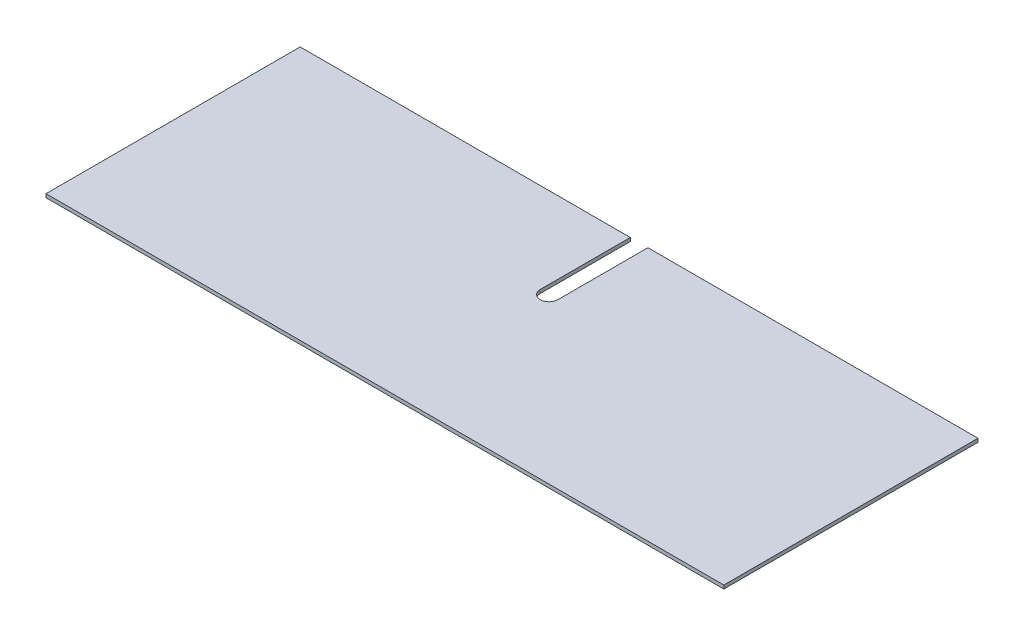
ISO-10303-21;
HEADER;
FILE_DESCRIPTION(('STEP AP214'),'2;1');
FILE_NAME('part.step','',(''),(''),'','','');
FILE_SCHEMA(('AUTOMOTIVE_DESIGN { 1 0 10303 214 1 1 1 1 }'));
ENDSEC;
DATA;
#1=APPLICATION_CONTEXT('core data for automotive mechanical design processes');
#2=APPLICATION_PROTOCOL_DEFINITION('international standard','automotive_design',2000,#1);
#3=PRODUCT_CONTEXT('',#1,'mechanical');
#4=PRODUCT('Part','Part','',(#3));
#5=PRODUCT_RELATED_PRODUCT_CATEGORY('part','',(#4));
#6=PRODUCT_DEFINITION_FORMATION('','',#4);
#7=PRODUCT_DEFINITION_CONTEXT('part definition',#1,'design');
#8=PRODUCT_DEFINITION('design','',#6,#7);
#9=PRODUCT_DEFINITION_SHAPE('','',#8);
#10=(LENGTH_UNIT() NAMED_UNIT(*) SI_UNIT(.MILLI.,.METRE.));
#11=(NAMED_UNIT(*) PLANE_ANGLE_UNIT() SI_UNIT($,.RADIAN.));
#12=(NAMED_UNIT(*) SI_UNIT($,.STERADIAN.) SOLID_ANGLE_UNIT());
#13=UNCERTAINTY_MEASURE_WITH_UNIT(LENGTH_MEASURE(1.E-05),#10,'distance_accuracy_value','');
#14=(GEOMETRIC_REPRESENTATION_CONTEXT(3) GLOBAL_UNCERTAINTY_ASSIGNED_CONTEXT((#13)) GLOBAL_UNIT_ASSIGNED_CONTEXT((#10,
#11,#12)) REPRESENTATION_CONTEXT('',''));
#15=CARTESIAN_POINT('',(0.,0.,0.));
#16=DIRECTION('',(0.,0.,1.));
#17=DIRECTION('',(1.,0.,0.));
#18=AXIS2_PLACEMENT_3D('',#15,#16,#17);
#19=CARTESIAN_POINT('',(0.,3.175,0.));
#20=DIRECTION('',(0.,1.,0.));
#21=DIRECTION('',(0.,0.,1.));
#22=AXIS2_PLACEMENT_3D('',#19,#20,#21);
#23=PLANE('',#22);
#24=CARTESIAN_POINT('',(0.,3.175,-33.3375));
#25=DIRECTION('',(0.,1.,0.));
#26=DIRECTION('',(0.,0.,1.));
#27=AXIS2_PLACEMENT_3D('',#24,#25,#26);
#28=CIRCLE('',#27,7.9375);
#29=CARTESIAN_POINT('',(7.9375,3.175,-33.3375));
#30=VERTEX_POINT('',#29);
#31=CARTESIAN_POINT('',(-7.9375,3.175,-33.3375));
#32=VERTEX_POINT('',#31);
#33=EDGE_CURVE('E19',#30,#32,#28,.F.);
#34=ORIENTED_EDGE('',*,*,#33,.T.);
#35=DIRECTION('',(0.,0.,1.));
#36=VECTOR('',#35,1.);
#37=CARTESIAN_POINT('',(-7.9375,3.175,-114.3));
#38=LINE('',#37,#36);
#39=CARTESIAN_POINT('',(-7.93749999999999,3.175,-114.3));
#40=VERTEX_POINT('',#39);
#41=EDGE_CURVE('E57',#32,#40,#38,.F.);
#42=ORIENTED_EDGE('',*,*,#41,.T.);
#43=DIRECTION('',(-1.,0.,0.));
#44=VECTOR('',#43,1.);
#45=CARTESIAN_POINT('',(304.8,3.175,-114.3));
#46=LINE('',#45,#44);
#47=CARTESIAN_POINT('',(-304.8,3.175,-114.3));
#48=VERTEX_POINT('',#47);
#49=EDGE_CURVE('E93',#48,#40,#46,.F.);
#50=ORIENTED_EDGE('',*,*,#49,.F.);
#51=DIRECTION('',(0.,0.,1.));
#52=VECTOR('',#51,1.);
#53=CARTESIAN_POINT('',(-304.8,3.175,-114.3));
#54=LINE('',#53,#52);
#55=CARTESIAN_POINT('',(-304.8,3.175,114.3));
#56=VERTEX_POINT('',#55);
#57=EDGE_CURVE('E88',#56,#48,#54,.F.);
#58=ORIENTED_EDGE('',*,*,#57,.F.);
#59=DIRECTION('',(1.,0.,0.));
#60=VECTOR('',#59,1.);
#61=CARTESIAN_POINT('',(-304.8,3.175,114.3));
#62=LINE('',#61,#60);
#63=CARTESIAN_POINT('',(304.8,3.175,114.3));
#64=VERTEX_POINT('',#63);
#65=EDGE_CURVE('E129',#64,#56,#62,.F.);
#66=ORIENTED_EDGE('',*,*,#65,.F.);
#67=DIRECTION('',(0.,0.,-1.));
#68=VECTOR('',#67,1.);
#69=CARTESIAN_POINT('',(304.8,3.175,114.3));
#70=LINE('',#69,#68);
#71=CARTESIAN_POINT('',(304.8,3.175,-114.3));
#72=VERTEX_POINT('',#71);
#73=EDGE_CURVE('E124',#72,#64,#70,.F.);
#74=ORIENTED_EDGE('',*,*,#73,.F.);
#75=DIRECTION('',(-1.,0.,0.));
#76=VECTOR('',#75,1.);
#77=CARTESIAN_POINT('',(304.8,3.175,-114.3));
#78=LINE('',#77,#76);
#79=CARTESIAN_POINT('',(7.93749999999999,3.175,-114.3));
#80=VERTEX_POINT('',#79);
#81=EDGE_CURVE('E63',#80,#72,#78,.F.);
#82=ORIENTED_EDGE('',*,*,#81,.F.);
#83=DIRECTION('',(0.,0.,-1.));
#84=VECTOR('',#83,1.);
#85=CARTESIAN_POINT('',(7.9375,3.175,-33.3375));
#86=LINE('',#85,#84);
#87=EDGE_CURVE('E50',#80,#30,#86,.F.);
#88=ORIENTED_EDGE('',*,*,#87,.T.);
#89=EDGE_LOOP('',(#34,#42,#50,#58,#66,#74,#82,#88));
#90=FACE_BOUND('',#89,.T.);
#91=ADVANCED_FACE('F16',(#90),#23,.T.);
#92=CARTESIAN_POINT('',(-7.9375,3.175,-114.3));
#93=DIRECTION('',(-1.,0.,0.));
#94=DIRECTION('',(0.,0.,1.));
#95=AXIS2_PLACEMENT_3D('',#92,#93,#94);
#96=PLANE('',#95);
#97=ORIENTED_EDGE('',*,*,#41,.F.);
#98=DIRECTION('',(0.,1.,0.));
#99=VECTOR('',#98,1.);
#100=CARTESIAN_POINT('',(-7.9375,3.175,-33.3375));
#101=LINE('',#100,#99);
#102=CARTESIAN_POINT('',(-7.9375,0.,-33.3375));
#103=VERTEX_POINT('',#102);
#104=EDGE_CURVE('E113',#32,#103,#101,.F.);
#105=ORIENTED_EDGE('',*,*,#104,.T.);
#106=DIRECTION('',(0.,0.,1.));
#107=VECTOR('',#106,1.);
#108=CARTESIAN_POINT('',(-7.9375,0.,0.));
#109=LINE('',#108,#107);
#110=CARTESIAN_POINT('',(-7.93749999999999,0.,-114.3));
#111=VERTEX_POINT('',#110);
#112=EDGE_CURVE('E103',#103,#111,#109,.F.);
#113=ORIENTED_EDGE('',*,*,#112,.T.);
#114=DIRECTION('',(0.,1.,0.));
#115=VECTOR('',#114,1.);
#116=CARTESIAN_POINT('',(-7.93749999999999,0.,-114.3));
#117=LINE('',#116,#115);
#118=EDGE_CURVE('E96',#40,#111,#117,.F.);
#119=ORIENTED_EDGE('',*,*,#118,.F.);
#120=EDGE_LOOP('',(#97,#105,#113,#119));
#121=FACE_BOUND('',#120,.T.);
#122=ADVANCED_FACE('F102',(#121),#96,.F.);
#123=CARTESIAN_POINT('',(304.8,0.,-114.3));
#124=DIRECTION('',(0.,0.,-1.));
#125=DIRECTION('',(-1.,0.,0.));
#126=AXIS2_PLACEMENT_3D('',#123,#124,#125);
#127=PLANE('',#126);
#128=ORIENTED_EDGE('',*,*,#49,.T.);
#129=ORIENTED_EDGE('',*,*,#118,.T.);
#130=DIRECTION('',(1.,0.,0.));
#131=VECTOR('',#130,1.);
#132=CARTESIAN_POINT('',(0.,0.,-114.3));
#133=LINE('',#132,#131);
#134=CARTESIAN_POINT('',(-304.8,0.,-114.3));
#135=VERTEX_POINT('',#134);
#136=EDGE_CURVE('E148',#111,#135,#133,.F.);
#137=ORIENTED_EDGE('',*,*,#136,.T.);
#138=DIRECTION('',(0.,1.,0.));
#139=VECTOR('',#138,1.);
#140=CARTESIAN_POINT('',(-304.8,0.,-114.3));
#141=LINE('',#140,#139);
#142=EDGE_CURVE('E98',#48,#135,#141,.F.);
#143=ORIENTED_EDGE('',*,*,#142,.F.);
#144=EDGE_LOOP('',(#128,#129,#137,#143));
#145=FACE_BOUND('',#144,.T.);
#146=ADVANCED_FACE('F94',(#145),#127,.T.);
#147=CARTESIAN_POINT('',(-304.8,0.,-114.3));
#148=DIRECTION('',(-1.,0.,0.));
#149=DIRECTION('',(0.,0.,1.));
#150=AXIS2_PLACEMENT_3D('',#147,#148,#149);
#151=PLANE('',#150);
#152=ORIENTED_EDGE('',*,*,#142,.T.);
#153=DIRECTION('',(0.,0.,1.));
#154=VECTOR('',#153,1.);
#155=CARTESIAN_POINT('',(-304.8,0.,0.));
#156=LINE('',#155,#154);
#157=CARTESIAN_POINT('',(-304.8,0.,114.3));
#158=VERTEX_POINT('',#157);
#159=EDGE_CURVE('E149',#135,#158,#156,.T.);
#160=ORIENTED_EDGE('',*,*,#159,.T.);
#161=DIRECTION('',(0.,1.,0.));
#162=VECTOR('',#161,1.);
#163=CARTESIAN_POINT('',(-304.8,0.,114.3));
#164=LINE('',#163,#162);
#165=EDGE_CURVE('E126',#56,#158,#164,.F.);
#166=ORIENTED_EDGE('',*,*,#165,.F.);
#167=ORIENTED_EDGE('',*,*,#57,.T.);
#168=EDGE_LOOP('',(#152,#160,#166,#167));
#169=FACE_BOUND('',#168,.T.);
#170=ADVANCED_FACE('F193',(#169),#151,.T.);
#171=CARTESIAN_POINT('',(-304.8,0.,114.3));
#172=DIRECTION('',(0.,0.,1.));
#173=DIRECTION('',(1.,0.,0.));
#174=AXIS2_PLACEMENT_3D('',#171,#172,#173);
#175=PLANE('',#174);
#176=ORIENTED_EDGE('',*,*,#165,.T.);
#177=DIRECTION('',(1.,0.,0.));
#178=VECTOR('',#177,1.);
#179=CARTESIAN_POINT('',(0.,0.,114.3));
#180=LINE('',#179,#178);
#181=CARTESIAN_POINT('',(304.8,0.,114.3));
#182=VERTEX_POINT('',#181);
#183=EDGE_CURVE('E150',#158,#182,#180,.T.);
#184=ORIENTED_EDGE('',*,*,#183,.T.);
#185=DIRECTION('',(0.,1.,0.));
#186=VECTOR('',#185,1.);
#187=CARTESIAN_POINT('',(304.8,0.,114.3));
#188=LINE('',#187,#186);
#189=EDGE_CURVE('E121',#64,#182,#188,.F.);
#190=ORIENTED_EDGE('',*,*,#189,.F.);
#191=ORIENTED_EDGE('',*,*,#65,.T.);
#192=EDGE_LOOP('',(#176,#184,#190,#191));
#193=FACE_BOUND('',#192,.T.);
#194=ADVANCED_FACE('F187',(#193),#175,.T.);
#195=CARTESIAN_POINT('',(304.8,0.,114.3));
#196=DIRECTION('',(1.,0.,0.));
#197=DIRECTION('',(0.,0.,-1.));
#198=AXIS2_PLACEMENT_3D('',#195,#196,#197);
#199=PLANE('',#198);
#200=ORIENTED_EDGE('',*,*,#189,.T.);
#201=DIRECTION('',(0.,0.,1.));
#202=VECTOR('',#201,1.);
#203=CARTESIAN_POINT('',(304.8,0.,0.));
#204=LINE('',#203,#202);
#205=CARTESIAN_POINT('',(304.8,0.,-114.3));
#206=VERTEX_POINT('',#205);
#207=EDGE_CURVE('E167',#182,#206,#204,.F.);
#208=ORIENTED_EDGE('',*,*,#207,.T.);
#209=DIRECTION('',(0.,1.,0.));
#210=VECTOR('',#209,1.);
#211=CARTESIAN_POINT('',(304.8,0.,-114.3));
#212=LINE('',#211,#210);
#213=EDGE_CURVE('E120',#72,#206,#212,.F.);
#214=ORIENTED_EDGE('',*,*,#213,.F.);
#215=ORIENTED_EDGE('',*,*,#73,.T.);
#216=EDGE_LOOP('',(#200,#208,#214,#215));
#217=FACE_BOUND('',#216,.T.);
#218=ADVANCED_FACE('F201',(#217),#199,.T.);
#219=CARTESIAN_POINT('',(304.8,0.,-114.3));
#220=DIRECTION('',(0.,0.,-1.));
#221=DIRECTION('',(-1.,0.,0.));
#222=AXIS2_PLACEMENT_3D('',#219,#220,#221);
#223=PLANE('',#222);
#224=DIRECTION('',(1.,0.,0.));
#225=VECTOR('',#224,1.);
#226=CARTESIAN_POINT('',(0.,0.,-114.3));
#227=LINE('',#226,#225);
#228=CARTESIAN_POINT('',(7.9375,0.,-114.3));
#229=VERTEX_POINT('',#228);
#230=EDGE_CURVE('E164',#206,#229,#227,.F.);
#231=ORIENTED_EDGE('',*,*,#230,.T.);
#232=DIRECTION('',(0.,1.,0.));
#233=VECTOR('',#232,1.);
#234=CARTESIAN_POINT('',(7.9375,3.175,-114.3));
#235=LINE('',#234,#233);
#236=EDGE_CURVE('E114',#229,#80,#235,.T.);
#237=ORIENTED_EDGE('',*,*,#236,.T.);
#238=ORIENTED_EDGE('',*,*,#81,.T.);
#239=ORIENTED_EDGE('',*,*,#213,.T.);
#240=EDGE_LOOP('',(#231,#237,#238,#239));
#241=FACE_BOUND('',#240,.T.);
#242=ADVANCED_FACE('F215',(#241),#223,.T.);
#243=CARTESIAN_POINT('',(7.9375,3.175,-33.3375));
#244=DIRECTION('',(1.,0.,0.));
#245=DIRECTION('',(0.,0.,-1.));
#246=AXIS2_PLACEMENT_3D('',#243,#244,#245);
#247=PLANE('',#246);
#248=ORIENTED_EDGE('',*,*,#87,.F.);
#249=ORIENTED_EDGE('',*,*,#236,.F.);
#250=DIRECTION('',(0.,0.,1.));
#251=VECTOR('',#250,1.);
#252=CARTESIAN_POINT('',(7.9375,0.,0.));
#253=LINE('',#252,#251);
#254=CARTESIAN_POINT('',(7.9375,0.,-33.3375));
#255=VERTEX_POINT('',#254);
#256=EDGE_CURVE('E25',#229,#255,#253,.T.);
#257=ORIENTED_EDGE('',*,*,#256,.T.);
#258=DIRECTION('',(0.,1.,0.));
#259=VECTOR('',#258,1.);
#260=CARTESIAN_POINT('',(7.9375,3.175,-33.3375));
#261=LINE('',#260,#259);
#262=EDGE_CURVE('E32',#255,#30,#261,.T.);
#263=ORIENTED_EDGE('',*,*,#262,.T.);
#264=EDGE_LOOP('',(#248,#249,#257,#263));
#265=FACE_BOUND('',#264,.T.);
#266=ADVANCED_FACE('F210',(#265),#247,.F.);
#267=CARTESIAN_POINT('',(0.,3.175,-33.3375));
#268=DIRECTION('',(0.,1.,0.));
#269=DIRECTION('',(0.,0.,1.));
#270=AXIS2_PLACEMENT_3D('',#267,#268,#269);
#271=CYLINDRICAL_SURFACE('',#270,7.9375);
#272=ORIENTED_EDGE('',*,*,#262,.F.);
#273=CARTESIAN_POINT('',(0.,0.,-33.3375));
#274=DIRECTION('',(0.,1.,0.));
#275=DIRECTION('',(0.,0.,1.));
#276=AXIS2_PLACEMENT_3D('',#273,#274,#275);
#277=CIRCLE('',#276,7.9375);
#278=EDGE_CURVE('E11',#255,#103,#277,.F.);
#279=ORIENTED_EDGE('',*,*,#278,.T.);
#280=ORIENTED_EDGE('',*,*,#104,.F.);
#281=ORIENTED_EDGE('',*,*,#33,.F.);
#282=EDGE_LOOP('',(#272,#279,#280,#281));
#283=FACE_BOUND('',#282,.T.);
#284=ADVANCED_FACE('F205',(#283),#271,.F.);
#285=CARTESIAN_POINT('',(0.,0.,0.));
#286=DIRECTION('',(0.,1.,0.));
#287=DIRECTION('',(0.,0.,1.));
#288=AXIS2_PLACEMENT_3D('',#285,#286,#287);
#289=PLANE('',#288);
#290=ORIENTED_EDGE('',*,*,#256,.F.);
#291=ORIENTED_EDGE('',*,*,#230,.F.);
#292=ORIENTED_EDGE('',*,*,#207,.F.);
#293=ORIENTED_EDGE('',*,*,#183,.F.);
#294=ORIENTED_EDGE('',*,*,#159,.F.);
#295=ORIENTED_EDGE('',*,*,#136,.F.);
#296=ORIENTED_EDGE('',*,*,#112,.F.);
#297=ORIENTED_EDGE('',*,*,#278,.F.);
#298=EDGE_LOOP('',(#290,#291,#292,#293,#294,#295,#296,#297));
#299=FACE_BOUND('',#298,.T.);
#300=ADVANCED_FACE('F191',(#299),#289,.F.);
#301=CLOSED_SHELL('',(#91,#122,#146,#170,#194,#218,#242,#266,#284,#300));
#302=MANIFOLD_SOLID_BREP('B1',#301);
#303=ADVANCED_BREP_SHAPE_REPRESENTATION('',(#18,#302),#14);
#304=SHAPE_DEFINITION_REPRESENTATION(#9,#303);
ENDSEC;
END-ISO-10303-21;
